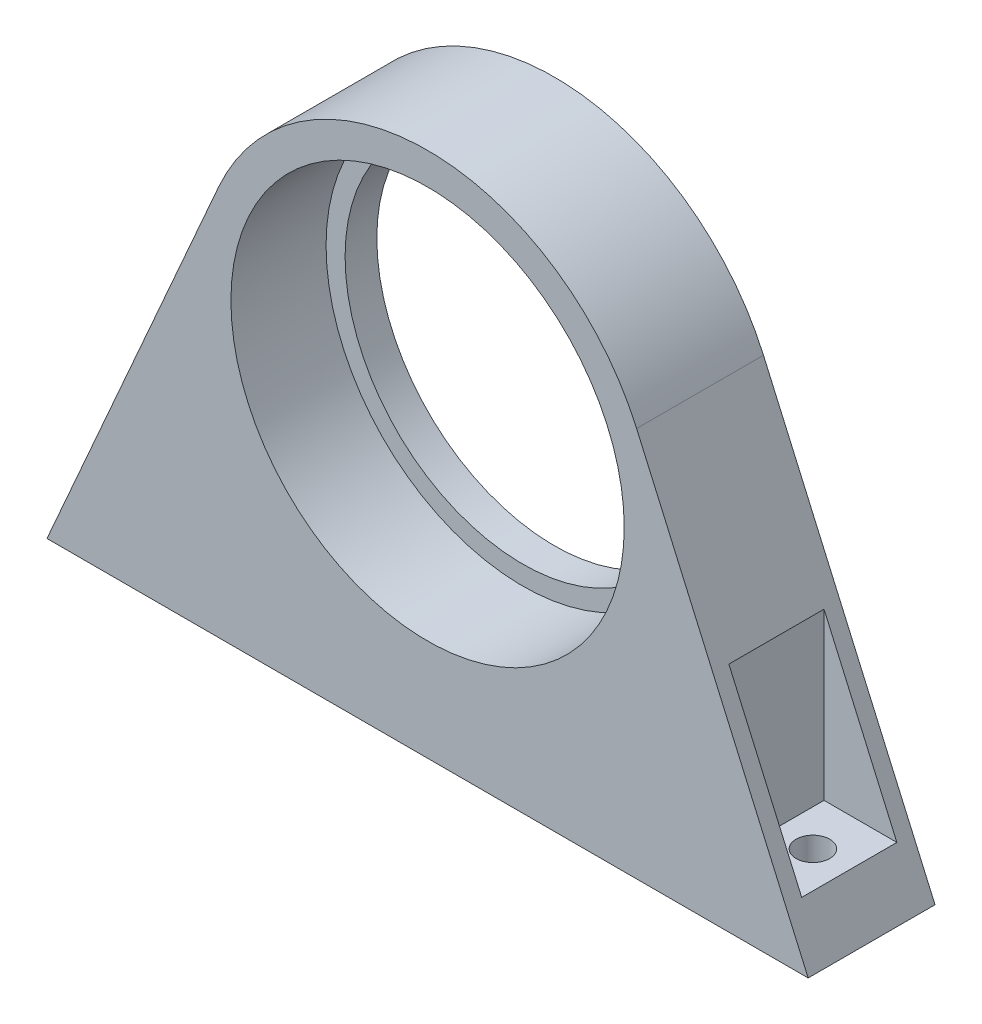
ISO-10303-21;
HEADER;
FILE_DESCRIPTION(('STEP AP214'),'2;1');
FILE_NAME('part.step','',(''),(''),'','','');
FILE_SCHEMA(('AUTOMOTIVE_DESIGN { 1 0 10303 214 1 1 1 1 }'));
ENDSEC;
DATA;
#1=APPLICATION_CONTEXT('core data for automotive mechanical design processes');
#2=APPLICATION_PROTOCOL_DEFINITION('international standard','automotive_design',2000,#1);
#3=PRODUCT_CONTEXT('',#1,'mechanical');
#4=PRODUCT('Part','Part','',(#3));
#5=PRODUCT_RELATED_PRODUCT_CATEGORY('part','',(#4));
#6=PRODUCT_DEFINITION_FORMATION('','',#4);
#7=PRODUCT_DEFINITION_CONTEXT('part definition',#1,'design');
#8=PRODUCT_DEFINITION('design','',#6,#7);
#9=PRODUCT_DEFINITION_SHAPE('','',#8);
#10=(LENGTH_UNIT() NAMED_UNIT(*) SI_UNIT(.MILLI.,.METRE.));
#11=(NAMED_UNIT(*) PLANE_ANGLE_UNIT() SI_UNIT($,.RADIAN.));
#12=(NAMED_UNIT(*) SI_UNIT($,.STERADIAN.) SOLID_ANGLE_UNIT());
#13=UNCERTAINTY_MEASURE_WITH_UNIT(LENGTH_MEASURE(1.E-05),#10,'distance_accuracy_value','');
#14=(GEOMETRIC_REPRESENTATION_CONTEXT(3) GLOBAL_UNCERTAINTY_ASSIGNED_CONTEXT((#13)) GLOBAL_UNIT_ASSIGNED_CONTEXT((#10,
#11,#12)) REPRESENTATION_CONTEXT('',''));
#15=CARTESIAN_POINT('',(0.,0.,0.));
#16=DIRECTION('',(0.,0.,1.));
#17=DIRECTION('',(1.,0.,0.));
#18=AXIS2_PLACEMENT_3D('',#15,#16,#17);
#19=CARTESIAN_POINT('',(0.,0.,20.));
#20=DIRECTION('',(0.,0.,-1.));
#21=DIRECTION('',(-1.,0.,0.));
#22=AXIS2_PLACEMENT_3D('',#19,#20,#21);
#23=CYLINDRICAL_SURFACE('',#22,31.);
#24=CARTESIAN_POINT('',(0.,0.,20.));
#25=DIRECTION('',(0.,0.,1.));
#26=DIRECTION('',(1.,0.,0.));
#27=AXIS2_PLACEMENT_3D('',#24,#25,#26);
#28=CIRCLE('',#27,31.);
#29=CARTESIAN_POINT('',(31.,0.,20.));
#30=VERTEX_POINT('',#29);
#31=EDGE_CURVE('E162',#30,#30,#28,.T.);
#32=ORIENTED_EDGE('',*,*,#31,.T.);
#33=EDGE_LOOP('',(#32));
#34=FACE_BOUND('',#33,.T.);
#35=CARTESIAN_POINT('',(0.,0.,5.));
#36=DIRECTION('',(0.,0.,-1.));
#37=DIRECTION('',(-1.,0.,0.));
#38=AXIS2_PLACEMENT_3D('',#35,#36,#37);
#39=CIRCLE('',#38,31.);
#40=CARTESIAN_POINT('',(-31.,0.,5.));
#41=VERTEX_POINT('',#40);
#42=EDGE_CURVE('E157',#41,#41,#39,.T.);
#43=ORIENTED_EDGE('',*,*,#42,.T.);
#44=EDGE_LOOP('',(#43));
#45=FACE_BOUND('',#44,.T.);
#46=ADVANCED_FACE('F39',(#34,#45),#23,.F.);
#47=CARTESIAN_POINT('',(0.,0.,20.));
#48=DIRECTION('',(0.,0.,-1.));
#49=DIRECTION('',(-1.,0.,0.));
#50=AXIS2_PLACEMENT_3D('',#47,#48,#49);
#51=PLANE('',#50);
#52=DIRECTION('',(1.,0.,0.));
#53=VECTOR('',#52,1.);
#54=CARTESIAN_POINT('',(60.,-47.,20.));
#55=LINE('',#54,#53);
#56=CARTESIAN_POINT('',(-60.,-47.,20.));
#57=VERTEX_POINT('',#56);
#58=CARTESIAN_POINT('',(60.,-47.,20.));
#59=VERTEX_POINT('',#58);
#60=EDGE_CURVE('E166',#57,#59,#55,.T.);
#61=ORIENTED_EDGE('',*,*,#60,.T.);
#62=DIRECTION('',(-0.402604913660944,0.915373849034406,0.));
#63=VECTOR('',#62,1.);
#64=CARTESIAN_POINT('',(32.9534585652386,14.493776891794,20.));
#65=LINE('',#64,#63);
#66=CARTESIAN_POINT('',(32.9534585652386,14.493776891794,20.));
#67=VERTEX_POINT('',#66);
#68=EDGE_CURVE('E169',#59,#67,#65,.T.);
#69=ORIENTED_EDGE('',*,*,#68,.T.);
#70=CARTESIAN_POINT('',(0.,0.,20.));
#71=DIRECTION('',(0.,0.,1.));
#72=DIRECTION('',(-1.,0.,0.));
#73=AXIS2_PLACEMENT_3D('',#70,#71,#72);
#74=CIRCLE('',#73,36.);
#75=CARTESIAN_POINT('',(-32.9534585652386,14.493776891794,20.));
#76=VERTEX_POINT('',#75);
#77=EDGE_CURVE('E172',#67,#76,#74,.T.);
#78=ORIENTED_EDGE('',*,*,#77,.T.);
#79=DIRECTION('',(-0.402604913660944,-0.915373849034406,0.));
#80=VECTOR('',#79,1.);
#81=CARTESIAN_POINT('',(-60.,-47.,20.));
#82=LINE('',#81,#80);
#83=EDGE_CURVE('E174',#76,#57,#82,.T.);
#84=ORIENTED_EDGE('',*,*,#83,.T.);
#85=EDGE_LOOP('',(#61,#69,#78,#84));
#86=FACE_BOUND('',#85,.T.);
#87=ORIENTED_EDGE('',*,*,#31,.F.);
#88=EDGE_LOOP('',(#87));
#89=FACE_BOUND('',#88,.T.);
#90=ADVANCED_FACE('F233',(#86,#89),#51,.F.);
#91=CARTESIAN_POINT('',(0.,0.,0.));
#92=DIRECTION('',(0.,0.,-1.));
#93=DIRECTION('',(-1.,0.,0.));
#94=AXIS2_PLACEMENT_3D('',#91,#92,#93);
#95=PLANE('',#94);
#96=DIRECTION('',(1.,0.,0.));
#97=VECTOR('',#96,1.);
#98=CARTESIAN_POINT('',(60.,-47.,0.));
#99=LINE('',#98,#97);
#100=CARTESIAN_POINT('',(-60.,-47.,0.));
#101=VERTEX_POINT('',#100);
#102=CARTESIAN_POINT('',(60.,-47.,0.));
#103=VERTEX_POINT('',#102);
#104=EDGE_CURVE('E165',#101,#103,#99,.T.);
#105=ORIENTED_EDGE('',*,*,#104,.F.);
#106=DIRECTION('',(-0.402604913660944,-0.915373849034406,0.));
#107=VECTOR('',#106,1.);
#108=CARTESIAN_POINT('',(-60.,-47.,0.));
#109=LINE('',#108,#107);
#110=CARTESIAN_POINT('',(-32.9534585652386,14.493776891794,0.));
#111=VERTEX_POINT('',#110);
#112=EDGE_CURVE('E170',#111,#101,#109,.T.);
#113=ORIENTED_EDGE('',*,*,#112,.F.);
#114=CARTESIAN_POINT('',(0.,0.,0.));
#115=DIRECTION('',(0.,0.,1.));
#116=DIRECTION('',(-1.,0.,0.));
#117=AXIS2_PLACEMENT_3D('',#114,#115,#116);
#118=CIRCLE('',#117,36.);
#119=CARTESIAN_POINT('',(32.9534585652386,14.493776891794,0.));
#120=VERTEX_POINT('',#119);
#121=EDGE_CURVE('E181',#120,#111,#118,.T.);
#122=ORIENTED_EDGE('',*,*,#121,.F.);
#123=DIRECTION('',(-0.402604913660944,0.915373849034406,0.));
#124=VECTOR('',#123,1.);
#125=CARTESIAN_POINT('',(32.9534585652386,14.493776891794,0.));
#126=LINE('',#125,#124);
#127=EDGE_CURVE('E179',#103,#120,#126,.T.);
#128=ORIENTED_EDGE('',*,*,#127,.F.);
#129=EDGE_LOOP('',(#105,#113,#122,#128));
#130=FACE_BOUND('',#129,.T.);
#131=CARTESIAN_POINT('',(0.,0.,0.));
#132=DIRECTION('',(0.,0.,-1.));
#133=DIRECTION('',(-1.,0.,0.));
#134=AXIS2_PLACEMENT_3D('',#131,#132,#133);
#135=CIRCLE('',#134,28.);
#136=CARTESIAN_POINT('',(-28.,0.,0.));
#137=VERTEX_POINT('',#136);
#138=EDGE_CURVE('E140',#137,#137,#135,.T.);
#139=ORIENTED_EDGE('',*,*,#138,.F.);
#140=EDGE_LOOP('',(#139));
#141=FACE_BOUND('',#140,.T.);
#142=ADVANCED_FACE('F241',(#130,#141),#95,.T.);
#143=CARTESIAN_POINT('',(60.,-47.,20.));
#144=DIRECTION('',(0.,1.,0.));
#145=DIRECTION('',(0.,0.,1.));
#146=AXIS2_PLACEMENT_3D('',#143,#144,#145);
#147=PLANE('',#146);
#148=CARTESIAN_POINT('',(-50.7406973321965,-47.,10.));
#149=DIRECTION('',(0.,1.,0.));
#150=DIRECTION('',(0.,0.,1.));
#151=AXIS2_PLACEMENT_3D('',#148,#149,#150);
#152=CIRCLE('',#151,2.65);
#153=CARTESIAN_POINT('',(-50.7406973321965,-47.,12.65));
#154=VERTEX_POINT('',#153);
#155=EDGE_CURVE('E147',#154,#154,#152,.T.);
#156=ORIENTED_EDGE('',*,*,#155,.T.);
#157=EDGE_LOOP('',(#156));
#158=FACE_BOUND('',#157,.T.);
#159=CARTESIAN_POINT('',(50.7406973321965,-47.,10.));
#160=DIRECTION('',(0.,1.,0.));
#161=DIRECTION('',(0.,0.,1.));
#162=AXIS2_PLACEMENT_3D('',#159,#160,#161);
#163=CIRCLE('',#162,2.65);
#164=CARTESIAN_POINT('',(50.7406973321965,-47.,12.65));
#165=VERTEX_POINT('',#164);
#166=EDGE_CURVE('E272',#165,#165,#163,.T.);
#167=ORIENTED_EDGE('',*,*,#166,.T.);
#168=EDGE_LOOP('',(#167));
#169=FACE_BOUND('',#168,.T.);
#170=ORIENTED_EDGE('',*,*,#104,.T.);
#171=DIRECTION('',(0.,0.,-1.));
#172=VECTOR('',#171,1.);
#173=CARTESIAN_POINT('',(60.,-47.,20.));
#174=LINE('',#173,#172);
#175=EDGE_CURVE('E192',#59,#103,#174,.T.);
#176=ORIENTED_EDGE('',*,*,#175,.F.);
#177=ORIENTED_EDGE('',*,*,#60,.F.);
#178=DIRECTION('',(0.,0.,-1.));
#179=VECTOR('',#178,1.);
#180=CARTESIAN_POINT('',(-60.,-47.,20.));
#181=LINE('',#180,#179);
#182=EDGE_CURVE('E176',#57,#101,#181,.T.);
#183=ORIENTED_EDGE('',*,*,#182,.T.);
#184=EDGE_LOOP('',(#170,#176,#177,#183));
#185=FACE_BOUND('',#184,.T.);
#186=ADVANCED_FACE('F41',(#158,#169,#185),#147,.F.);
#187=CARTESIAN_POINT('',(32.9534585652386,14.493776891794,20.));
#188=DIRECTION('',(-0.915373849034406,-0.402604913660944,0.));
#189=DIRECTION('',(0.402604913660944,-0.915373849034406,0.));
#190=AXIS2_PLACEMENT_3D('',#187,#188,#189);
#191=PLANE('',#190);
#192=DIRECTION('',(0.,0.,-1.));
#193=VECTOR('',#192,1.);
#194=CARTESIAN_POINT('',(45.,-12.8955783458733,20.));
#195=LINE('',#194,#193);
#196=CARTESIAN_POINT('',(45.,-12.8955783458733,17.5));
#197=VERTEX_POINT('',#196);
#198=CARTESIAN_POINT('',(45.,-12.8955783458733,2.5));
#199=VERTEX_POINT('',#198);
#200=EDGE_CURVE('E47',#197,#199,#195,.T.);
#201=ORIENTED_EDGE('',*,*,#200,.T.);
#202=DIRECTION('',(0.402604913660944,-0.915373849034406,0.));
#203=VECTOR('',#202,1.);
#204=CARTESIAN_POINT('',(32.9534585652386,14.493776891794,2.5));
#205=LINE('',#204,#203);
#206=CARTESIAN_POINT('',(56.481394664393,-39.,2.5));
#207=VERTEX_POINT('',#206);
#208=EDGE_CURVE('E11',#199,#207,#205,.T.);
#209=ORIENTED_EDGE('',*,*,#208,.T.);
#210=DIRECTION('',(0.,0.,-1.));
#211=VECTOR('',#210,1.);
#212=CARTESIAN_POINT('',(56.481394664393,-39.,20.));
#213=LINE('',#212,#211);
#214=CARTESIAN_POINT('',(56.481394664393,-39.,17.5));
#215=VERTEX_POINT('',#214);
#216=EDGE_CURVE('E202',#215,#207,#213,.T.);
#217=ORIENTED_EDGE('',*,*,#216,.F.);
#218=DIRECTION('',(-0.402604913660944,0.915373849034406,0.));
#219=VECTOR('',#218,1.);
#220=CARTESIAN_POINT('',(32.9534585652386,14.493776891794,17.5));
#221=LINE('',#220,#219);
#222=EDGE_CURVE('E204',#215,#197,#221,.T.);
#223=ORIENTED_EDGE('',*,*,#222,.T.);
#224=EDGE_LOOP('',(#201,#209,#217,#223));
#225=FACE_BOUND('',#224,.T.);
#226=ORIENTED_EDGE('',*,*,#127,.T.);
#227=DIRECTION('',(0.,0.,-1.));
#228=VECTOR('',#227,1.);
#229=CARTESIAN_POINT('',(32.9534585652386,14.493776891794,20.));
#230=LINE('',#229,#228);
#231=EDGE_CURVE('E189',#67,#120,#230,.T.);
#232=ORIENTED_EDGE('',*,*,#231,.F.);
#233=ORIENTED_EDGE('',*,*,#68,.F.);
#234=ORIENTED_EDGE('',*,*,#175,.T.);
#235=EDGE_LOOP('',(#226,#232,#233,#234));
#236=FACE_BOUND('',#235,.T.);
#237=ADVANCED_FACE('F208',(#225,#236),#191,.F.);
#238=CARTESIAN_POINT('',(0.,0.,20.));
#239=DIRECTION('',(0.,0.,-1.));
#240=DIRECTION('',(-1.,0.,0.));
#241=AXIS2_PLACEMENT_3D('',#238,#239,#240);
#242=CYLINDRICAL_SURFACE('',#241,36.);
#243=ORIENTED_EDGE('',*,*,#121,.T.);
#244=DIRECTION('',(0.,0.,-1.));
#245=VECTOR('',#244,1.);
#246=CARTESIAN_POINT('',(-32.9534585652386,14.493776891794,20.));
#247=LINE('',#246,#245);
#248=EDGE_CURVE('E186',#76,#111,#247,.T.);
#249=ORIENTED_EDGE('',*,*,#248,.F.);
#250=ORIENTED_EDGE('',*,*,#77,.F.);
#251=ORIENTED_EDGE('',*,*,#231,.T.);
#252=EDGE_LOOP('',(#243,#249,#250,#251));
#253=FACE_BOUND('',#252,.T.);
#254=ADVANCED_FACE('F254',(#253),#242,.T.);
#255=CARTESIAN_POINT('',(-60.,-47.,20.));
#256=DIRECTION('',(0.915373849034406,-0.402604913660944,0.));
#257=DIRECTION('',(0.402604913660944,0.915373849034406,0.));
#258=AXIS2_PLACEMENT_3D('',#255,#256,#257);
#259=PLANE('',#258);
#260=DIRECTION('',(0.,0.,1.));
#261=VECTOR('',#260,1.);
#262=CARTESIAN_POINT('',(-45.,-12.8955783458733,20.));
#263=LINE('',#262,#261);
#264=CARTESIAN_POINT('',(-45.,-12.8955783458733,2.5));
#265=VERTEX_POINT('',#264);
#266=CARTESIAN_POINT('',(-45.,-12.8955783458734,17.5));
#267=VERTEX_POINT('',#266);
#268=EDGE_CURVE('E124',#265,#267,#263,.T.);
#269=ORIENTED_EDGE('',*,*,#268,.T.);
#270=DIRECTION('',(-0.402604913660944,-0.915373849034406,0.));
#271=VECTOR('',#270,1.);
#272=CARTESIAN_POINT('',(-60.,-47.,17.5));
#273=LINE('',#272,#271);
#274=CARTESIAN_POINT('',(-56.481394664393,-39.,17.5));
#275=VERTEX_POINT('',#274);
#276=EDGE_CURVE('E199',#267,#275,#273,.T.);
#277=ORIENTED_EDGE('',*,*,#276,.T.);
#278=DIRECTION('',(0.,0.,-1.));
#279=VECTOR('',#278,1.);
#280=CARTESIAN_POINT('',(-56.481394664393,-39.,20.));
#281=LINE('',#280,#279);
#282=CARTESIAN_POINT('',(-56.481394664393,-39.,2.5));
#283=VERTEX_POINT('',#282);
#284=EDGE_CURVE('E195',#275,#283,#281,.T.);
#285=ORIENTED_EDGE('',*,*,#284,.T.);
#286=DIRECTION('',(0.402604913660944,0.915373849034406,0.));
#287=VECTOR('',#286,1.);
#288=CARTESIAN_POINT('',(-60.,-47.,2.5));
#289=LINE('',#288,#287);
#290=EDGE_CURVE('E131',#283,#265,#289,.T.);
#291=ORIENTED_EDGE('',*,*,#290,.T.);
#292=EDGE_LOOP('',(#269,#277,#285,#291));
#293=FACE_BOUND('',#292,.T.);
#294=ORIENTED_EDGE('',*,*,#112,.T.);
#295=ORIENTED_EDGE('',*,*,#182,.F.);
#296=ORIENTED_EDGE('',*,*,#83,.F.);
#297=ORIENTED_EDGE('',*,*,#248,.T.);
#298=EDGE_LOOP('',(#294,#295,#296,#297));
#299=FACE_BOUND('',#298,.T.);
#300=ADVANCED_FACE('F251',(#293,#299),#259,.F.);
#301=CARTESIAN_POINT('',(0.,0.,5.));
#302=DIRECTION('',(0.,0.,-1.));
#303=DIRECTION('',(-1.,0.,0.));
#304=AXIS2_PLACEMENT_3D('',#301,#302,#303);
#305=PLANE('',#304);
#306=CARTESIAN_POINT('',(0.,0.,5.));
#307=DIRECTION('',(0.,0.,-1.));
#308=DIRECTION('',(-1.,0.,0.));
#309=AXIS2_PLACEMENT_3D('',#306,#307,#308);
#310=CIRCLE('',#309,28.);
#311=CARTESIAN_POINT('',(-28.,0.,5.));
#312=VERTEX_POINT('',#311);
#313=EDGE_CURVE('E154',#312,#312,#310,.T.);
#314=ORIENTED_EDGE('',*,*,#313,.T.);
#315=EDGE_LOOP('',(#314));
#316=FACE_BOUND('',#315,.T.);
#317=ORIENTED_EDGE('',*,*,#42,.F.);
#318=EDGE_LOOP('',(#317));
#319=FACE_BOUND('',#318,.T.);
#320=ADVANCED_FACE('F246',(#316,#319),#305,.F.);
#321=CARTESIAN_POINT('',(0.,0.,5.));
#322=DIRECTION('',(0.,0.,-1.));
#323=DIRECTION('',(-1.,0.,0.));
#324=AXIS2_PLACEMENT_3D('',#321,#322,#323);
#325=CYLINDRICAL_SURFACE('',#324,28.);
#326=ORIENTED_EDGE('',*,*,#313,.F.);
#327=EDGE_LOOP('',(#326));
#328=FACE_BOUND('',#327,.T.);
#329=ORIENTED_EDGE('',*,*,#138,.T.);
#330=EDGE_LOOP('',(#329));
#331=FACE_BOUND('',#330,.T.);
#332=ADVANCED_FACE('F289',(#328,#331),#325,.F.);
#333=CARTESIAN_POINT('',(-60.,36.,17.5));
#334=DIRECTION('',(0.,0.,1.));
#335=DIRECTION('',(1.,0.,0.));
#336=AXIS2_PLACEMENT_3D('',#333,#334,#335);
#337=PLANE('',#336);
#338=DIRECTION('',(0.,-1.,0.));
#339=VECTOR('',#338,1.);
#340=CARTESIAN_POINT('',(-45.,36.,17.5));
#341=LINE('',#340,#339);
#342=CARTESIAN_POINT('',(-45.,-39.,17.5));
#343=VERTEX_POINT('',#342);
#344=EDGE_CURVE('E127',#267,#343,#341,.T.);
#345=ORIENTED_EDGE('',*,*,#344,.T.);
#346=DIRECTION('',(-1.,0.,0.));
#347=VECTOR('',#346,1.);
#348=CARTESIAN_POINT('',(-60.,-39.,17.5));
#349=LINE('',#348,#347);
#350=EDGE_CURVE('E128',#343,#275,#349,.T.);
#351=ORIENTED_EDGE('',*,*,#350,.T.);
#352=ORIENTED_EDGE('',*,*,#276,.F.);
#353=EDGE_LOOP('',(#345,#351,#352));
#354=FACE_BOUND('',#353,.T.);
#355=ADVANCED_FACE('F290',(#354),#337,.F.);
#356=CARTESIAN_POINT('',(-45.,36.,17.5));
#357=DIRECTION('',(1.,0.,0.));
#358=DIRECTION('',(0.,0.,-1.));
#359=AXIS2_PLACEMENT_3D('',#356,#357,#358);
#360=PLANE('',#359);
#361=DIRECTION('',(0.,-1.,0.));
#362=VECTOR('',#361,1.);
#363=CARTESIAN_POINT('',(-45.,36.,2.5));
#364=LINE('',#363,#362);
#365=CARTESIAN_POINT('',(-45.,-39.,2.5));
#366=VERTEX_POINT('',#365);
#367=EDGE_CURVE('E118',#265,#366,#364,.T.);
#368=ORIENTED_EDGE('',*,*,#367,.T.);
#369=DIRECTION('',(0.,0.,1.));
#370=VECTOR('',#369,1.);
#371=CARTESIAN_POINT('',(-45.,-39.,17.5));
#372=LINE('',#371,#370);
#373=EDGE_CURVE('E121',#366,#343,#372,.T.);
#374=ORIENTED_EDGE('',*,*,#373,.T.);
#375=ORIENTED_EDGE('',*,*,#344,.F.);
#376=ORIENTED_EDGE('',*,*,#268,.F.);
#377=EDGE_LOOP('',(#368,#374,#375,#376));
#378=FACE_BOUND('',#377,.T.);
#379=ADVANCED_FACE('F119',(#378),#360,.F.);
#380=CARTESIAN_POINT('',(-60.,36.,2.5));
#381=DIRECTION('',(0.,0.,-1.));
#382=DIRECTION('',(-1.,0.,0.));
#383=AXIS2_PLACEMENT_3D('',#380,#381,#382);
#384=PLANE('',#383);
#385=DIRECTION('',(1.,0.,0.));
#386=VECTOR('',#385,1.);
#387=CARTESIAN_POINT('',(-60.,-39.,2.5));
#388=LINE('',#387,#386);
#389=EDGE_CURVE('E62',#283,#366,#388,.T.);
#390=ORIENTED_EDGE('',*,*,#389,.T.);
#391=ORIENTED_EDGE('',*,*,#367,.F.);
#392=ORIENTED_EDGE('',*,*,#290,.F.);
#393=EDGE_LOOP('',(#390,#391,#392));
#394=FACE_BOUND('',#393,.T.);
#395=ADVANCED_FACE('F130',(#394),#384,.F.);
#396=CARTESIAN_POINT('',(0.,-39.,0.));
#397=DIRECTION('',(0.,-1.,0.));
#398=DIRECTION('',(0.,0.,-1.));
#399=AXIS2_PLACEMENT_3D('',#396,#397,#398);
#400=PLANE('',#399);
#401=CARTESIAN_POINT('',(-50.7406973321965,-39.,10.));
#402=DIRECTION('',(0.,1.,0.));
#403=DIRECTION('',(0.,0.,1.));
#404=AXIS2_PLACEMENT_3D('',#401,#402,#403);
#405=CIRCLE('',#404,2.65);
#406=CARTESIAN_POINT('',(-50.7406973321965,-39.,12.65));
#407=VERTEX_POINT('',#406);
#408=EDGE_CURVE('E314',#407,#407,#405,.T.);
#409=ORIENTED_EDGE('',*,*,#408,.F.);
#410=EDGE_LOOP('',(#409));
#411=FACE_BOUND('',#410,.T.);
#412=ORIENTED_EDGE('',*,*,#350,.F.);
#413=ORIENTED_EDGE('',*,*,#373,.F.);
#414=ORIENTED_EDGE('',*,*,#389,.F.);
#415=ORIENTED_EDGE('',*,*,#284,.F.);
#416=EDGE_LOOP('',(#412,#413,#414,#415));
#417=FACE_BOUND('',#416,.T.);
#418=ADVANCED_FACE('F134',(#411,#417),#400,.F.);
#419=CARTESIAN_POINT('',(60.,36.,2.5));
#420=DIRECTION('',(0.,0.,-1.));
#421=DIRECTION('',(-1.,0.,0.));
#422=AXIS2_PLACEMENT_3D('',#419,#420,#421);
#423=PLANE('',#422);
#424=DIRECTION('',(0.,-1.,0.));
#425=VECTOR('',#424,1.);
#426=CARTESIAN_POINT('',(45.,36.,2.5));
#427=LINE('',#426,#425);
#428=CARTESIAN_POINT('',(45.,-39.,2.5));
#429=VERTEX_POINT('',#428);
#430=EDGE_CURVE('E145',#199,#429,#427,.T.);
#431=ORIENTED_EDGE('',*,*,#430,.T.);
#432=DIRECTION('',(1.,0.,0.));
#433=VECTOR('',#432,1.);
#434=CARTESIAN_POINT('',(60.,-39.,2.5));
#435=LINE('',#434,#433);
#436=EDGE_CURVE('E144',#429,#207,#435,.T.);
#437=ORIENTED_EDGE('',*,*,#436,.T.);
#438=ORIENTED_EDGE('',*,*,#208,.F.);
#439=EDGE_LOOP('',(#431,#437,#438));
#440=FACE_BOUND('',#439,.T.);
#441=ADVANCED_FACE('F220',(#440),#423,.F.);
#442=CARTESIAN_POINT('',(45.,36.,17.5));
#443=DIRECTION('',(-1.,0.,0.));
#444=DIRECTION('',(0.,0.,1.));
#445=AXIS2_PLACEMENT_3D('',#442,#443,#444);
#446=PLANE('',#445);
#447=DIRECTION('',(0.,-1.,0.));
#448=VECTOR('',#447,1.);
#449=CARTESIAN_POINT('',(45.,36.,17.5));
#450=LINE('',#449,#448);
#451=CARTESIAN_POINT('',(45.,-39.,17.5));
#452=VERTEX_POINT('',#451);
#453=EDGE_CURVE('E142',#197,#452,#450,.T.);
#454=ORIENTED_EDGE('',*,*,#453,.T.);
#455=DIRECTION('',(0.,0.,-1.));
#456=VECTOR('',#455,1.);
#457=CARTESIAN_POINT('',(45.,-39.,17.5));
#458=LINE('',#457,#456);
#459=EDGE_CURVE('E150',#452,#429,#458,.T.);
#460=ORIENTED_EDGE('',*,*,#459,.T.);
#461=ORIENTED_EDGE('',*,*,#430,.F.);
#462=ORIENTED_EDGE('',*,*,#200,.F.);
#463=EDGE_LOOP('',(#454,#460,#461,#462));
#464=FACE_BOUND('',#463,.T.);
#465=ADVANCED_FACE('F214',(#464),#446,.F.);
#466=CARTESIAN_POINT('',(60.,36.,17.5));
#467=DIRECTION('',(0.,0.,1.));
#468=DIRECTION('',(1.,0.,0.));
#469=AXIS2_PLACEMENT_3D('',#466,#467,#468);
#470=PLANE('',#469);
#471=DIRECTION('',(-1.,0.,0.));
#472=VECTOR('',#471,1.);
#473=CARTESIAN_POINT('',(60.,-39.,17.5));
#474=LINE('',#473,#472);
#475=EDGE_CURVE('E54',#215,#452,#474,.T.);
#476=ORIENTED_EDGE('',*,*,#475,.T.);
#477=ORIENTED_EDGE('',*,*,#453,.F.);
#478=ORIENTED_EDGE('',*,*,#222,.F.);
#479=EDGE_LOOP('',(#476,#477,#478));
#480=FACE_BOUND('',#479,.T.);
#481=ADVANCED_FACE('F216',(#480),#470,.F.);
#482=CARTESIAN_POINT('',(0.,-39.,0.));
#483=DIRECTION('',(0.,1.,0.));
#484=DIRECTION('',(0.,0.,1.));
#485=AXIS2_PLACEMENT_3D('',#482,#483,#484);
#486=PLANE('',#485);
#487=CARTESIAN_POINT('',(50.7406973321965,-39.,10.));
#488=DIRECTION('',(0.,1.,0.));
#489=DIRECTION('',(0.,0.,1.));
#490=AXIS2_PLACEMENT_3D('',#487,#488,#489);
#491=CIRCLE('',#490,2.65);
#492=CARTESIAN_POINT('',(50.7406973321965,-39.,12.65));
#493=VERTEX_POINT('',#492);
#494=EDGE_CURVE('E312',#493,#493,#491,.T.);
#495=ORIENTED_EDGE('',*,*,#494,.F.);
#496=EDGE_LOOP('',(#495));
#497=FACE_BOUND('',#496,.T.);
#498=ORIENTED_EDGE('',*,*,#216,.T.);
#499=ORIENTED_EDGE('',*,*,#436,.F.);
#500=ORIENTED_EDGE('',*,*,#459,.F.);
#501=ORIENTED_EDGE('',*,*,#475,.F.);
#502=EDGE_LOOP('',(#498,#499,#500,#501));
#503=FACE_BOUND('',#502,.T.);
#504=ADVANCED_FACE('F218',(#497,#503),#486,.T.);
#505=CARTESIAN_POINT('',(50.7406973321965,-47.,10.));
#506=DIRECTION('',(0.,1.,0.));
#507=DIRECTION('',(0.,0.,1.));
#508=AXIS2_PLACEMENT_3D('',#505,#506,#507);
#509=CYLINDRICAL_SURFACE('',#508,2.65);
#510=ORIENTED_EDGE('',*,*,#166,.F.);
#511=EDGE_LOOP('',(#510));
#512=FACE_BOUND('',#511,.T.);
#513=ORIENTED_EDGE('',*,*,#494,.T.);
#514=EDGE_LOOP('',(#513));
#515=FACE_BOUND('',#514,.T.);
#516=ADVANCED_FACE('F301',(#512,#515),#509,.F.);
#517=CARTESIAN_POINT('',(-50.7406973321965,-47.,10.));
#518=DIRECTION('',(0.,1.,0.));
#519=DIRECTION('',(0.,0.,1.));
#520=AXIS2_PLACEMENT_3D('',#517,#518,#519);
#521=CYLINDRICAL_SURFACE('',#520,2.65);
#522=ORIENTED_EDGE('',*,*,#155,.F.);
#523=EDGE_LOOP('',(#522));
#524=FACE_BOUND('',#523,.T.);
#525=ORIENTED_EDGE('',*,*,#408,.T.);
#526=EDGE_LOOP('',(#525));
#527=FACE_BOUND('',#526,.T.);
#528=ADVANCED_FACE('F306',(#524,#527),#521,.F.);
#529=CLOSED_SHELL('',(#46,#90,#142,#186,#237,#254,#300,#320,#332,#355,#379,#395,#418,#441,#465,
#481,#504,#516,#528));
#530=MANIFOLD_SOLID_BREP('B2',#529);
#531=ADVANCED_BREP_SHAPE_REPRESENTATION('',(#18,#530),#14);
#532=SHAPE_DEFINITION_REPRESENTATION(#9,#531);
ENDSEC;
END-ISO-10303-21;
